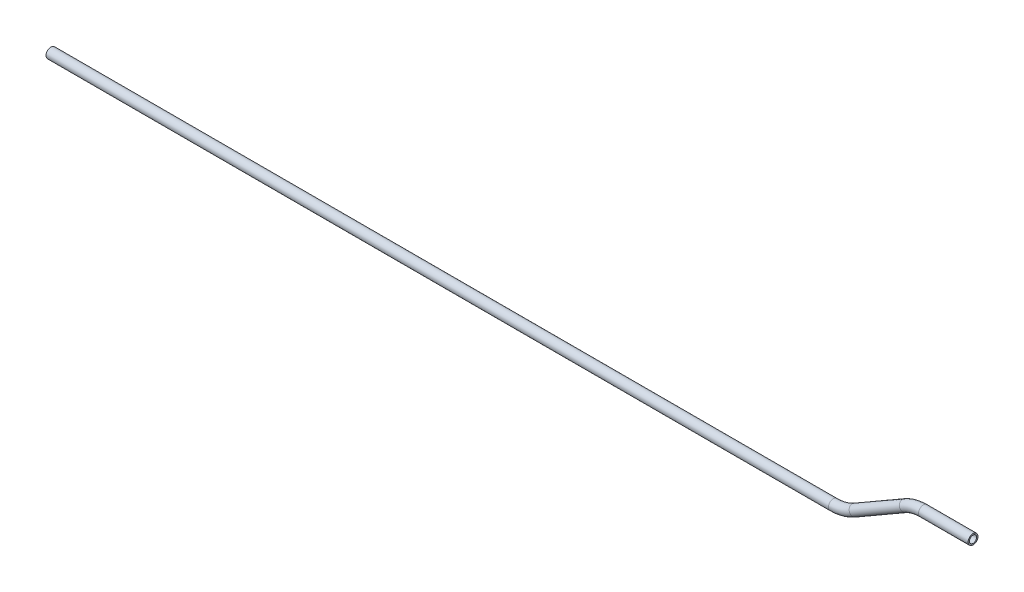
ISO-10303-21;
HEADER;
FILE_DESCRIPTION(('STEP AP214'),'2;1');
FILE_NAME('part.step','',(''),(''),'','','');
FILE_SCHEMA(('AUTOMOTIVE_DESIGN { 1 0 10303 214 1 1 1 1 }'));
ENDSEC;
DATA;
#1=APPLICATION_CONTEXT('core data for automotive mechanical design processes');
#2=APPLICATION_PROTOCOL_DEFINITION('international standard','automotive_design',2000,#1);
#3=PRODUCT_CONTEXT('',#1,'mechanical');
#4=PRODUCT('Part','Part','',(#3));
#5=PRODUCT_RELATED_PRODUCT_CATEGORY('part','',(#4));
#6=PRODUCT_DEFINITION_FORMATION('','',#4);
#7=PRODUCT_DEFINITION_CONTEXT('part definition',#1,'design');
#8=PRODUCT_DEFINITION('design','',#6,#7);
#9=PRODUCT_DEFINITION_SHAPE('','',#8);
#10=(LENGTH_UNIT() NAMED_UNIT(*) SI_UNIT(.MILLI.,.METRE.));
#11=(NAMED_UNIT(*) PLANE_ANGLE_UNIT() SI_UNIT($,.RADIAN.));
#12=(NAMED_UNIT(*) SI_UNIT($,.STERADIAN.) SOLID_ANGLE_UNIT());
#13=UNCERTAINTY_MEASURE_WITH_UNIT(LENGTH_MEASURE(1.E-05),#10,'distance_accuracy_value','');
#14=(GEOMETRIC_REPRESENTATION_CONTEXT(3) GLOBAL_UNCERTAINTY_ASSIGNED_CONTEXT((#13)) GLOBAL_UNIT_ASSIGNED_CONTEXT((#10,
#11,#12)) REPRESENTATION_CONTEXT('',''));
#15=CARTESIAN_POINT('',(0.,0.,0.));
#16=DIRECTION('',(0.,0.,1.));
#17=DIRECTION('',(1.,0.,0.));
#18=AXIS2_PLACEMENT_3D('',#15,#16,#17);
#19=CARTESIAN_POINT('',(-558.334087778049,-25.4000000000037,0.));
#20=DIRECTION('',(1.,0.,0.));
#21=DIRECTION('',(0.,1.,0.));
#22=AXIS2_PLACEMENT_3D('',#19,#20,#21);
#23=CYLINDRICAL_SURFACE('',#22,3.175);
#24=CARTESIAN_POINT('',(-57.672010970273,-25.4000000000001,0.));
#25=DIRECTION('',(1.,0.,0.));
#26=DIRECTION('',(0.,1.,0.));
#27=AXIS2_PLACEMENT_3D('',#24,#25,#26);
#28=CIRCLE('',#27,3.175);
#29=CARTESIAN_POINT('',(-57.672010970273,-28.5749999999999,0.));
#30=VERTEX_POINT('',#29);
#31=EDGE_CURVE('E56',#30,#30,#28,.T.);
#32=ORIENTED_EDGE('',*,*,#31,.F.);
#33=EDGE_LOOP('',(#32));
#34=FACE_BOUND('',#33,.T.);
#35=CARTESIAN_POINT('',(-558.334087778049,-25.4000000000037,0.));
#36=DIRECTION('',(1.,0.,0.));
#37=DIRECTION('',(0.,1.,0.));
#38=AXIS2_PLACEMENT_3D('',#35,#36,#37);
#39=CIRCLE('',#38,3.175);
#40=CARTESIAN_POINT('',(-558.334087778049,-22.2250000000037,0.));
#41=VERTEX_POINT('',#40);
#42=EDGE_CURVE('E53',#41,#41,#39,.T.);
#43=ORIENTED_EDGE('',*,*,#42,.T.);
#44=EDGE_LOOP('',(#43));
#45=FACE_BOUND('',#44,.T.);
#46=ADVANCED_FACE('F32',(#34,#45),#23,.T.);
#47=CARTESIAN_POINT('',(-57.672010970273,1.98550217542068,0.));
#48=DIRECTION('',(0.,0.,1.));
#49=DIRECTION('',(1.,0.,0.));
#50=AXIS2_PLACEMENT_3D('',#47,#48,#49);
#51=TOROIDAL_SURFACE('',#50,27.3855021754206,3.175);
#52=CARTESIAN_POINT('',(-43.9792598825628,-21.7310384038876,0.));
#53=DIRECTION('',(0.86602540378444,0.499999999999998,0.));
#54=DIRECTION('',(-0.499999999999998,0.86602540378444,0.));
#55=AXIS2_PLACEMENT_3D('',#52,#53,#54);
#56=CIRCLE('',#55,3.175);
#57=CARTESIAN_POINT('',(-42.3917598825628,-24.4806690609032,0.));
#58=VERTEX_POINT('',#57);
#59=EDGE_CURVE('E59',#58,#58,#56,.T.);
#60=CARTESIAN_POINT('',(-57.672010970273,1.98550217542068,0.));
#61=DIRECTION('',(0.,0.,1.));
#62=DIRECTION('',(1.,0.,0.));
#63=AXIS2_PLACEMENT_3D('',#60,#61,#62);
#64=CIRCLE('',#63,30.5605021754206);
#65=EDGE_CURVE('',#30,#58,#64,.T.);
#66=ORIENTED_EDGE('',*,*,#31,.T.);
#67=ORIENTED_EDGE('',*,*,#59,.F.);
#68=ORIENTED_EDGE('',*,*,#65,.T.);
#69=ORIENTED_EDGE('',*,*,#65,.F.);
#70=EDGE_LOOP('',(#66,#68,#67,#69));
#71=FACE_BOUND('',#70,.T.);
#72=ADVANCED_FACE('F78',(#71),#51,.T.);
#73=CARTESIAN_POINT('',(-43.9792598825628,-21.7310384038875,0.));
#74=DIRECTION('',(0.866025403784437,0.500000000000003,0.));
#75=DIRECTION('',(-0.500000000000003,0.866025403784437,0.));
#76=AXIS2_PLACEMENT_3D('',#73,#74,#75);
#77=CYLINDRICAL_SURFACE('',#76,3.175);
#78=CARTESIAN_POINT('',(-11.8305959579056,-3.16999863289972,0.));
#79=DIRECTION('',(0.866025403784437,0.500000000000003,0.));
#80=DIRECTION('',(-0.500000000000003,0.866025403784437,0.));
#81=AXIS2_PLACEMENT_3D('',#78,#79,#80);
#82=CIRCLE('',#81,3.175);
#83=CARTESIAN_POINT('',(-13.4180959579056,-0.420367975884135,0.));
#84=VERTEX_POINT('',#83);
#85=EDGE_CURVE('E61',#84,#84,#82,.T.);
#86=ORIENTED_EDGE('',*,*,#85,.F.);
#87=EDGE_LOOP('',(#86));
#88=FACE_BOUND('',#87,.T.);
#89=ORIENTED_EDGE('',*,*,#59,.T.);
#90=EDGE_LOOP('',(#89));
#91=FACE_BOUND('',#90,.T.);
#92=ADVANCED_FACE('F71',(#88,#91),#77,.T.);
#93=CARTESIAN_POINT('',(0.,-23.661191915811,0.));
#94=DIRECTION('',(0.,0.,-1.));
#95=DIRECTION('',(-1.,0.,0.));
#96=AXIS2_PLACEMENT_3D('',#93,#94,#95);
#97=TOROIDAL_SURFACE('',#96,23.661191915811,3.175);
#98=CARTESIAN_POINT('',(0.,0.,0.));
#99=DIRECTION('',(1.,0.,0.));
#100=DIRECTION('',(0.,1.,0.));
#101=AXIS2_PLACEMENT_3D('',#98,#99,#100);
#102=CIRCLE('',#101,3.175);
#103=CARTESIAN_POINT('',(0.,3.175,0.));
#104=VERTEX_POINT('',#103);
#105=EDGE_CURVE('E36',#104,#104,#102,.T.);
#106=CARTESIAN_POINT('',(0.,-23.661191915811,0.));
#107=DIRECTION('',(0.,0.,-1.));
#108=DIRECTION('',(-1.,0.,0.));
#109=AXIS2_PLACEMENT_3D('',#106,#107,#108);
#110=CIRCLE('',#109,26.836191915811);
#111=EDGE_CURVE('',#84,#104,#110,.T.);
#112=ORIENTED_EDGE('',*,*,#85,.T.);
#113=ORIENTED_EDGE('',*,*,#105,.F.);
#114=ORIENTED_EDGE('',*,*,#111,.T.);
#115=ORIENTED_EDGE('',*,*,#111,.F.);
#116=EDGE_LOOP('',(#112,#114,#113,#115));
#117=FACE_BOUND('',#116,.T.);
#118=ADVANCED_FACE('F69',(#117),#97,.T.);
#119=CARTESIAN_POINT('',(0.,0.,0.));
#120=DIRECTION('',(1.,0.,0.));
#121=DIRECTION('',(0.,1.,0.));
#122=AXIS2_PLACEMENT_3D('',#119,#120,#121);
#123=CYLINDRICAL_SURFACE('',#122,3.175);
#124=CARTESIAN_POINT('',(31.7600027342006,0.,0.));
#125=DIRECTION('',(1.,0.,0.));
#126=DIRECTION('',(0.,1.,0.));
#127=AXIS2_PLACEMENT_3D('',#124,#125,#126);
#128=CIRCLE('',#127,3.175);
#129=CARTESIAN_POINT('',(31.7600027342006,3.175,0.));
#130=VERTEX_POINT('',#129);
#131=EDGE_CURVE('E49',#130,#130,#128,.T.);
#132=ORIENTED_EDGE('',*,*,#131,.F.);
#133=EDGE_LOOP('',(#132));
#134=FACE_BOUND('',#133,.T.);
#135=ORIENTED_EDGE('',*,*,#105,.T.);
#136=EDGE_LOOP('',(#135));
#137=FACE_BOUND('',#136,.T.);
#138=ADVANCED_FACE('F34',(#134,#137),#123,.T.);
#139=CARTESIAN_POINT('',(-558.334087778049,-25.4000000000037,0.));
#140=DIRECTION('',(1.,0.,0.));
#141=DIRECTION('',(0.,1.,0.));
#142=AXIS2_PLACEMENT_3D('',#139,#140,#141);
#143=PLANE('',#142);
#144=CARTESIAN_POINT('',(-558.334087778049,-25.4000000000037,0.));
#145=DIRECTION('',(1.,0.,0.));
#146=DIRECTION('',(0.,1.,0.));
#147=AXIS2_PLACEMENT_3D('',#144,#145,#146);
#148=CIRCLE('',#147,2.286);
#149=CARTESIAN_POINT('',(-558.334087778049,-23.1140000000037,0.));
#150=VERTEX_POINT('',#149);
#151=EDGE_CURVE('E52',#150,#150,#148,.F.);
#152=ORIENTED_EDGE('',*,*,#151,.F.);
#153=EDGE_LOOP('',(#152));
#154=FACE_BOUND('',#153,.T.);
#155=ORIENTED_EDGE('',*,*,#42,.F.);
#156=EDGE_LOOP('',(#155));
#157=FACE_BOUND('',#156,.T.);
#158=ADVANCED_FACE('F76',(#154,#157),#143,.F.);
#159=CARTESIAN_POINT('',(31.7600027342006,0.,0.));
#160=DIRECTION('',(1.,0.,0.));
#161=DIRECTION('',(0.,1.,0.));
#162=AXIS2_PLACEMENT_3D('',#159,#160,#161);
#163=PLANE('',#162);
#164=CARTESIAN_POINT('',(31.7600027342006,0.,0.));
#165=DIRECTION('',(1.,0.,0.));
#166=DIRECTION('',(0.,1.,0.));
#167=AXIS2_PLACEMENT_3D('',#164,#165,#166);
#168=CIRCLE('',#167,2.286);
#169=CARTESIAN_POINT('',(31.7600027342006,2.286,0.));
#170=VERTEX_POINT('',#169);
#171=EDGE_CURVE('E10',#170,#170,#168,.F.);
#172=ORIENTED_EDGE('',*,*,#171,.T.);
#173=EDGE_LOOP('',(#172));
#174=FACE_BOUND('',#173,.T.);
#175=ORIENTED_EDGE('',*,*,#131,.T.);
#176=EDGE_LOOP('',(#175));
#177=FACE_BOUND('',#176,.T.);
#178=ADVANCED_FACE('F95',(#174,#177),#163,.T.);
#179=CARTESIAN_POINT('',(-558.334087778049,-25.4000000000037,0.));
#180=DIRECTION('',(1.,0.,0.));
#181=DIRECTION('',(0.,1.,0.));
#182=AXIS2_PLACEMENT_3D('',#179,#180,#181);
#183=CYLINDRICAL_SURFACE('',#182,2.286);
#184=CARTESIAN_POINT('',(-57.672010970273,-25.4000000000001,0.));
#185=DIRECTION('',(1.,0.,0.));
#186=DIRECTION('',(0.,1.,0.));
#187=AXIS2_PLACEMENT_3D('',#184,#185,#186);
#188=CIRCLE('',#187,2.286);
#189=CARTESIAN_POINT('',(-57.672010970273,-27.6859999999999,0.));
#190=VERTEX_POINT('',#189);
#191=EDGE_CURVE('E191',#190,#190,#188,.F.);
#192=ORIENTED_EDGE('',*,*,#191,.F.);
#193=EDGE_LOOP('',(#192));
#194=FACE_BOUND('',#193,.T.);
#195=ORIENTED_EDGE('',*,*,#151,.T.);
#196=EDGE_LOOP('',(#195));
#197=FACE_BOUND('',#196,.T.);
#198=ADVANCED_FACE('F98',(#194,#197),#183,.F.);
#199=CARTESIAN_POINT('',(-57.672010970273,1.98550217542068,0.));
#200=DIRECTION('',(0.,0.,1.));
#201=DIRECTION('',(1.,0.,0.));
#202=AXIS2_PLACEMENT_3D('',#199,#200,#201);
#203=TOROIDAL_SURFACE('',#202,27.3855021754206,2.286);
#204=CARTESIAN_POINT('',(-43.9792598825628,-21.7310384038876,0.));
#205=DIRECTION('',(0.86602540378444,0.499999999999998,0.));
#206=DIRECTION('',(-0.499999999999998,0.86602540378444,0.));
#207=AXIS2_PLACEMENT_3D('',#204,#205,#206);
#208=CIRCLE('',#207,2.286);
#209=CARTESIAN_POINT('',(-42.8362598825628,-23.7107724769388,0.));
#210=VERTEX_POINT('',#209);
#211=EDGE_CURVE('E190',#210,#210,#208,.F.);
#212=CARTESIAN_POINT('',(-57.672010970273,1.98550217542068,0.));
#213=DIRECTION('',(0.,0.,1.));
#214=DIRECTION('',(1.,0.,0.));
#215=AXIS2_PLACEMENT_3D('',#212,#213,#214);
#216=CIRCLE('',#215,29.6715021754206);
#217=EDGE_CURVE('',#190,#210,#216,.T.);
#218=ORIENTED_EDGE('',*,*,#191,.T.);
#219=ORIENTED_EDGE('',*,*,#211,.F.);
#220=ORIENTED_EDGE('',*,*,#217,.T.);
#221=ORIENTED_EDGE('',*,*,#217,.F.);
#222=EDGE_LOOP('',(#218,#220,#219,#221));
#223=FACE_BOUND('',#222,.T.);
#224=ADVANCED_FACE('F153',(#223),#203,.F.);
#225=CARTESIAN_POINT('',(-43.9792598825628,-21.7310384038875,0.));
#226=DIRECTION('',(0.866025403784437,0.500000000000003,0.));
#227=DIRECTION('',(-0.500000000000003,0.866025403784437,0.));
#228=AXIS2_PLACEMENT_3D('',#225,#226,#227);
#229=CYLINDRICAL_SURFACE('',#228,2.286);
#230=CARTESIAN_POINT('',(-11.8305959579056,-3.16999863289972,0.));
#231=DIRECTION('',(0.866025403784437,0.500000000000003,0.));
#232=DIRECTION('',(-0.500000000000003,0.866025403784437,0.));
#233=AXIS2_PLACEMENT_3D('',#230,#231,#232);
#234=CIRCLE('',#233,2.286);
#235=CARTESIAN_POINT('',(-12.9735959579056,-1.1902645598485,0.));
#236=VERTEX_POINT('',#235);
#237=EDGE_CURVE('E45',#236,#236,#234,.F.);
#238=ORIENTED_EDGE('',*,*,#237,.F.);
#239=EDGE_LOOP('',(#238));
#240=FACE_BOUND('',#239,.T.);
#241=ORIENTED_EDGE('',*,*,#211,.T.);
#242=EDGE_LOOP('',(#241));
#243=FACE_BOUND('',#242,.T.);
#244=ADVANCED_FACE('F89',(#240,#243),#229,.F.);
#245=CARTESIAN_POINT('',(0.,-23.661191915811,0.));
#246=DIRECTION('',(0.,0.,-1.));
#247=DIRECTION('',(-1.,0.,0.));
#248=AXIS2_PLACEMENT_3D('',#245,#246,#247);
#249=TOROIDAL_SURFACE('',#248,23.661191915811,2.286);
#250=CARTESIAN_POINT('',(0.,0.,0.));
#251=DIRECTION('',(1.,0.,0.));
#252=DIRECTION('',(0.,1.,0.));
#253=AXIS2_PLACEMENT_3D('',#250,#251,#252);
#254=CIRCLE('',#253,2.286);
#255=CARTESIAN_POINT('',(0.,2.286,0.));
#256=VERTEX_POINT('',#255);
#257=EDGE_CURVE('E40',#256,#256,#254,.F.);
#258=CARTESIAN_POINT('',(0.,-23.661191915811,0.));
#259=DIRECTION('',(0.,0.,-1.));
#260=DIRECTION('',(-1.,0.,0.));
#261=AXIS2_PLACEMENT_3D('',#258,#259,#260);
#262=CIRCLE('',#261,25.947191915811);
#263=EDGE_CURVE('',#236,#256,#262,.T.);
#264=ORIENTED_EDGE('',*,*,#237,.T.);
#265=ORIENTED_EDGE('',*,*,#257,.F.);
#266=ORIENTED_EDGE('',*,*,#263,.T.);
#267=ORIENTED_EDGE('',*,*,#263,.F.);
#268=EDGE_LOOP('',(#264,#266,#265,#267));
#269=FACE_BOUND('',#268,.T.);
#270=ADVANCED_FACE('F83',(#269),#249,.F.);
#271=CARTESIAN_POINT('',(0.,0.,0.));
#272=DIRECTION('',(1.,0.,0.));
#273=DIRECTION('',(0.,1.,0.));
#274=AXIS2_PLACEMENT_3D('',#271,#272,#273);
#275=CYLINDRICAL_SURFACE('',#274,2.286);
#276=ORIENTED_EDGE('',*,*,#171,.F.);
#277=EDGE_LOOP('',(#276));
#278=FACE_BOUND('',#277,.T.);
#279=ORIENTED_EDGE('',*,*,#257,.T.);
#280=EDGE_LOOP('',(#279));
#281=FACE_BOUND('',#280,.T.);
#282=ADVANCED_FACE('F81',(#278,#281),#275,.F.);
#283=CLOSED_SHELL('',(#46,#72,#92,#118,#138,#158,#178,#198,#224,#244,#270,#282));
#284=MANIFOLD_SOLID_BREP('B2',#283);
#285=ADVANCED_BREP_SHAPE_REPRESENTATION('',(#18,#284),#14);
#286=SHAPE_DEFINITION_REPRESENTATION(#9,#285);
ENDSEC;
END-ISO-10303-21;
